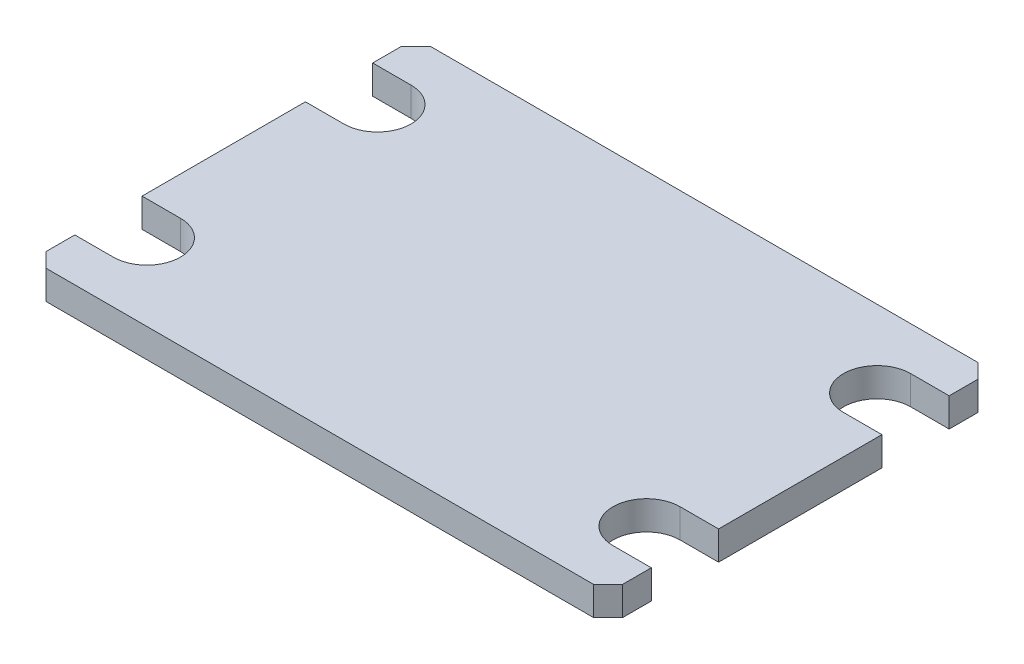
ISO-10303-21;
HEADER;
FILE_DESCRIPTION(('STEP AP214'),'2;1');
FILE_NAME('part.step','',(''),(''),'','','');
FILE_SCHEMA(('AUTOMOTIVE_DESIGN { 1 0 10303 214 1 1 1 1 }'));
ENDSEC;
DATA;
#1=APPLICATION_CONTEXT('core data for automotive mechanical design processes');
#2=APPLICATION_PROTOCOL_DEFINITION('international standard','automotive_design',2000,#1);
#3=PRODUCT_CONTEXT('',#1,'mechanical');
#4=PRODUCT('Part','Part','',(#3));
#5=PRODUCT_RELATED_PRODUCT_CATEGORY('part','',(#4));
#6=PRODUCT_DEFINITION_FORMATION('','',#4);
#7=PRODUCT_DEFINITION_CONTEXT('part definition',#1,'design');
#8=PRODUCT_DEFINITION('design','',#6,#7);
#9=PRODUCT_DEFINITION_SHAPE('','',#8);
#10=(LENGTH_UNIT() NAMED_UNIT(*) SI_UNIT(.MILLI.,.METRE.));
#11=(NAMED_UNIT(*) PLANE_ANGLE_UNIT() SI_UNIT($,.RADIAN.));
#12=(NAMED_UNIT(*) SI_UNIT($,.STERADIAN.) SOLID_ANGLE_UNIT());
#13=UNCERTAINTY_MEASURE_WITH_UNIT(LENGTH_MEASURE(1.E-05),#10,'distance_accuracy_value','');
#14=(GEOMETRIC_REPRESENTATION_CONTEXT(3) GLOBAL_UNCERTAINTY_ASSIGNED_CONTEXT((#13)) GLOBAL_UNIT_ASSIGNED_CONTEXT((#10,
#11,#12)) REPRESENTATION_CONTEXT('',''));
#15=CARTESIAN_POINT('',(0.,0.,0.));
#16=DIRECTION('',(0.,0.,1.));
#17=DIRECTION('',(1.,0.,0.));
#18=AXIS2_PLACEMENT_3D('',#15,#16,#17);
#19=CARTESIAN_POINT('',(190.499999999998,19.0500000000001,-126.999999999999));
#20=DIRECTION('',(1.,0.,0.));
#21=DIRECTION('',(0.,0.,-1.));
#22=AXIS2_PLACEMENT_3D('',#19,#20,#21);
#23=PLANE('',#22);
#24=DIRECTION('',(0.,0.,1.));
#25=VECTOR('',#24,1.);
#26=CARTESIAN_POINT('',(190.499999999998,19.0500000000001,-126.999999999999));
#27=LINE('',#26,#25);
#28=CARTESIAN_POINT('',(190.499999999998,19.0500000000001,98.4250000000009));
#29=VERTEX_POINT('',#28);
#30=CARTESIAN_POINT('',(190.499999999998,19.0500000000001,117.474999999999));
#31=VERTEX_POINT('',#30);
#32=EDGE_CURVE('E354',#29,#31,#27,.T.);
#33=ORIENTED_EDGE('',*,*,#32,.T.);
#34=DIRECTION('',(0.,-1.,0.));
#35=VECTOR('',#34,1.);
#36=CARTESIAN_POINT('',(190.5,0.,117.474999999999));
#37=LINE('',#36,#35);
#38=CARTESIAN_POINT('',(190.5,0.,117.474999999999));
#39=VERTEX_POINT('',#38);
#40=EDGE_CURVE('E359',#31,#39,#37,.T.);
#41=ORIENTED_EDGE('',*,*,#40,.T.);
#42=DIRECTION('',(0.,0.,1.));
#43=VECTOR('',#42,1.);
#44=CARTESIAN_POINT('',(190.5,0.,-126.999999999999));
#45=LINE('',#44,#43);
#46=CARTESIAN_POINT('',(190.5,0.,98.4250000000009));
#47=VERTEX_POINT('',#46);
#48=EDGE_CURVE('E341',#47,#39,#45,.T.);
#49=ORIENTED_EDGE('',*,*,#48,.F.);
#50=DIRECTION('',(0.,-1.,0.));
#51=VECTOR('',#50,1.);
#52=CARTESIAN_POINT('',(190.499999999998,19.0500000000001,98.4250000000009));
#53=LINE('',#52,#51);
#54=EDGE_CURVE('E243',#29,#47,#53,.T.);
#55=ORIENTED_EDGE('',*,*,#54,.F.);
#56=EDGE_LOOP('',(#33,#41,#49,#55));
#57=FACE_BOUND('',#56,.T.);
#58=ADVANCED_FACE('F42',(#57),#23,.T.);
#59=CARTESIAN_POINT('',(-190.5,19.0500000000003,-127.000000000001));
#60=DIRECTION('',(0.,1.,0.));
#61=DIRECTION('',(0.,0.,1.));
#62=AXIS2_PLACEMENT_3D('',#59,#60,#61);
#63=PLANE('',#62);
#64=DIRECTION('',(1.,0.,0.));
#65=VECTOR('',#64,1.);
#66=CARTESIAN_POINT('',(-190.5,19.0500000000003,126.999999999999));
#67=LINE('',#66,#65);
#68=CARTESIAN_POINT('',(-180.975,19.0500000000001,126.999999999999));
#69=VERTEX_POINT('',#68);
#70=CARTESIAN_POINT('',(180.974999999997,19.05,126.999999999999));
#71=VERTEX_POINT('',#70);
#72=EDGE_CURVE('E333',#69,#71,#67,.T.);
#73=ORIENTED_EDGE('',*,*,#72,.T.);
#74=DIRECTION('',(0.707106781186543,0.,-0.707106781186553));
#75=VECTOR('',#74,1.);
#76=CARTESIAN_POINT('',(122.237500000001,19.0499999999999,185.737499999997));
#77=LINE('',#76,#75);
#78=EDGE_CURVE('E380',#71,#31,#77,.T.);
#79=ORIENTED_EDGE('',*,*,#78,.T.);
#80=ORIENTED_EDGE('',*,*,#32,.F.);
#81=DIRECTION('',(-1.,0.,0.));
#82=VECTOR('',#81,1.);
#83=CARTESIAN_POINT('',(190.499999999998,19.0500000000001,98.4250000000009));
#84=LINE('',#83,#82);
#85=CARTESIAN_POINT('',(165.1,19.0500000000004,98.4250000000009));
#86=VERTEX_POINT('',#85);
#87=EDGE_CURVE('E226',#29,#86,#84,.T.);
#88=ORIENTED_EDGE('',*,*,#87,.T.);
#89=CARTESIAN_POINT('',(165.1,19.0500000000004,76.2000000000009));
#90=DIRECTION('',(0.,-1.,0.));
#91=DIRECTION('',(0.,0.,-1.));
#92=AXIS2_PLACEMENT_3D('',#89,#90,#91);
#93=CIRCLE('',#92,22.225);
#94=CARTESIAN_POINT('',(165.1,19.0500000000004,53.975000000001));
#95=VERTEX_POINT('',#94);
#96=EDGE_CURVE('E217',#86,#95,#93,.T.);
#97=ORIENTED_EDGE('',*,*,#96,.T.);
#98=DIRECTION('',(1.,0.,0.));
#99=VECTOR('',#98,1.);
#100=CARTESIAN_POINT('',(165.1,19.0500000000004,53.975000000001));
#101=LINE('',#100,#99);
#102=CARTESIAN_POINT('',(190.499999999998,19.0500000000001,53.975000000001));
#103=VERTEX_POINT('',#102);
#104=EDGE_CURVE('E212',#95,#103,#101,.T.);
#105=ORIENTED_EDGE('',*,*,#104,.T.);
#106=CARTESIAN_POINT('',(190.499999999998,19.0500000000001,-53.974999999999));
#107=VERTEX_POINT('',#106);
#108=EDGE_CURVE('E353',#107,#103,#27,.T.);
#109=ORIENTED_EDGE('',*,*,#108,.F.);
#110=DIRECTION('',(-1.,0.,0.));
#111=VECTOR('',#110,1.);
#112=CARTESIAN_POINT('',(190.499999999998,19.0500000000001,-53.974999999999));
#113=LINE('',#112,#111);
#114=CARTESIAN_POINT('',(165.1,19.0500000000004,-53.974999999999));
#115=VERTEX_POINT('',#114);
#116=EDGE_CURVE('E256',#107,#115,#113,.T.);
#117=ORIENTED_EDGE('',*,*,#116,.T.);
#118=CARTESIAN_POINT('',(165.1,19.0500000000004,-76.1999999999992));
#119=DIRECTION('',(0.,-1.,0.));
#120=DIRECTION('',(0.,0.,-1.));
#121=AXIS2_PLACEMENT_3D('',#118,#119,#120);
#122=CIRCLE('',#121,22.225);
#123=CARTESIAN_POINT('',(165.1,19.0500000000004,-98.4249999999991));
#124=VERTEX_POINT('',#123);
#125=EDGE_CURVE('E260',#115,#124,#122,.T.);
#126=ORIENTED_EDGE('',*,*,#125,.T.);
#127=DIRECTION('',(-1.,0.,0.));
#128=VECTOR('',#127,1.);
#129=CARTESIAN_POINT('',(190.499999999998,19.0500000000001,-98.4249999999991));
#130=LINE('',#129,#128);
#131=CARTESIAN_POINT('',(190.499999999998,19.0500000000001,-98.4249999999991));
#132=VERTEX_POINT('',#131);
#133=EDGE_CURVE('E250',#132,#124,#130,.T.);
#134=ORIENTED_EDGE('',*,*,#133,.F.);
#135=CARTESIAN_POINT('',(190.499999999998,19.0500000000001,-117.474999999999));
#136=VERTEX_POINT('',#135);
#137=EDGE_CURVE('E351',#136,#132,#27,.T.);
#138=ORIENTED_EDGE('',*,*,#137,.F.);
#139=DIRECTION('',(-0.707106781186552,0.,-0.707106781186543));
#140=VECTOR('',#139,1.);
#141=CARTESIAN_POINT('',(-4.76250000000289,19.0499999999996,-312.7375));
#142=LINE('',#141,#140);
#143=CARTESIAN_POINT('',(180.974999999997,19.05,-126.999999999999));
#144=VERTEX_POINT('',#143);
#145=EDGE_CURVE('E376',#136,#144,#142,.T.);
#146=ORIENTED_EDGE('',*,*,#145,.T.);
#147=DIRECTION('',(-1.,0.,0.));
#148=VECTOR('',#147,1.);
#149=CARTESIAN_POINT('',(190.499999999998,19.0500000000001,-126.999999999999));
#150=LINE('',#149,#148);
#151=CARTESIAN_POINT('',(-180.975,19.0500000000001,-126.999999999999));
#152=VERTEX_POINT('',#151);
#153=EDGE_CURVE('E349',#144,#152,#150,.T.);
#154=ORIENTED_EDGE('',*,*,#153,.T.);
#155=DIRECTION('',(-0.707106781186543,0.,0.707106781186553));
#156=VECTOR('',#155,1.);
#157=CARTESIAN_POINT('',(-185.737499999999,19.0500000000004,-122.2375));
#158=LINE('',#157,#156);
#159=CARTESIAN_POINT('',(-190.5,19.0500000000003,-117.474999999999));
#160=VERTEX_POINT('',#159);
#161=EDGE_CURVE('E65',#152,#160,#158,.T.);
#162=ORIENTED_EDGE('',*,*,#161,.T.);
#163=DIRECTION('',(0.,0.,-1.));
#164=VECTOR('',#163,1.);
#165=CARTESIAN_POINT('',(-190.5,19.0500000000003,126.999999999999));
#166=LINE('',#165,#164);
#167=CARTESIAN_POINT('',(-190.5,19.0500000000003,-98.4250000000007));
#168=VERTEX_POINT('',#167);
#169=EDGE_CURVE('E348',#168,#160,#166,.T.);
#170=ORIENTED_EDGE('',*,*,#169,.F.);
#171=DIRECTION('',(1.,0.,0.));
#172=VECTOR('',#171,1.);
#173=CARTESIAN_POINT('',(-190.5,19.0500000000003,-98.4250000000007));
#174=LINE('',#173,#172);
#175=CARTESIAN_POINT('',(-165.099999999997,19.0500000000002,-98.4250000000007));
#176=VERTEX_POINT('',#175);
#177=EDGE_CURVE('E283',#168,#176,#174,.T.);
#178=ORIENTED_EDGE('',*,*,#177,.T.);
#179=CARTESIAN_POINT('',(-165.099999999997,19.0500000000002,-76.2000000000007));
#180=DIRECTION('',(0.,-1.,0.));
#181=DIRECTION('',(0.,0.,-1.));
#182=AXIS2_PLACEMENT_3D('',#179,#180,#181);
#183=CIRCLE('',#182,22.225);
#184=CARTESIAN_POINT('',(-165.099999999997,19.0500000000002,-53.9750000000008));
#185=VERTEX_POINT('',#184);
#186=EDGE_CURVE('E287',#176,#185,#183,.T.);
#187=ORIENTED_EDGE('',*,*,#186,.T.);
#188=DIRECTION('',(1.,0.,0.));
#189=VECTOR('',#188,1.);
#190=CARTESIAN_POINT('',(-190.5,19.0500000000003,-53.9750000000008));
#191=LINE('',#190,#189);
#192=CARTESIAN_POINT('',(-190.5,19.0500000000003,-53.9750000000008));
#193=VERTEX_POINT('',#192);
#194=EDGE_CURVE('E277',#193,#185,#191,.T.);
#195=ORIENTED_EDGE('',*,*,#194,.F.);
#196=CARTESIAN_POINT('',(-190.5,19.0500000000003,53.9749999999992));
#197=VERTEX_POINT('',#196);
#198=EDGE_CURVE('E347',#197,#193,#166,.T.);
#199=ORIENTED_EDGE('',*,*,#198,.F.);
#200=DIRECTION('',(1.,0.,0.));
#201=VECTOR('',#200,1.);
#202=CARTESIAN_POINT('',(-190.5,19.0500000000003,53.9749999999992));
#203=LINE('',#202,#201);
#204=CARTESIAN_POINT('',(-165.099999999997,19.0500000000002,53.9749999999992));
#205=VERTEX_POINT('',#204);
#206=EDGE_CURVE('E310',#197,#205,#203,.T.);
#207=ORIENTED_EDGE('',*,*,#206,.T.);
#208=CARTESIAN_POINT('',(-165.099999999997,19.0500000000002,76.1999999999992));
#209=DIRECTION('',(0.,-1.,0.));
#210=DIRECTION('',(0.,0.,-1.));
#211=AXIS2_PLACEMENT_3D('',#208,#209,#210);
#212=CIRCLE('',#211,22.225);
#213=CARTESIAN_POINT('',(-165.099999999997,19.0500000000002,98.4249999999991));
#214=VERTEX_POINT('',#213);
#215=EDGE_CURVE('E314',#205,#214,#212,.T.);
#216=ORIENTED_EDGE('',*,*,#215,.T.);
#217=DIRECTION('',(1.,0.,0.));
#218=VECTOR('',#217,1.);
#219=CARTESIAN_POINT('',(-190.5,19.0500000000003,98.4249999999991));
#220=LINE('',#219,#218);
#221=CARTESIAN_POINT('',(-190.5,19.0500000000003,98.4249999999991));
#222=VERTEX_POINT('',#221);
#223=EDGE_CURVE('E304',#222,#214,#220,.T.);
#224=ORIENTED_EDGE('',*,*,#223,.F.);
#225=CARTESIAN_POINT('',(-190.5,19.0500000000003,117.474999999999));
#226=VERTEX_POINT('',#225);
#227=EDGE_CURVE('E344',#226,#222,#166,.T.);
#228=ORIENTED_EDGE('',*,*,#227,.F.);
#229=DIRECTION('',(0.707106781186552,0.,0.707106781186543));
#230=VECTOR('',#229,1.);
#231=CARTESIAN_POINT('',(-312.7375,19.0499999999997,-4.76249999999956));
#232=LINE('',#231,#230);
#233=EDGE_CURVE('E378',#226,#69,#232,.T.);
#234=ORIENTED_EDGE('',*,*,#233,.T.);
#235=EDGE_LOOP('',(#73,#79,#80,#88,#97,#105,#109,#117,#126,#134,#138,#146,#154,#162,#170,#178,
#187,#195,#199,#207,#216,#224,#228,#234));
#236=FACE_BOUND('',#235,.T.);
#237=ADVANCED_FACE('F396',(#236),#63,.T.);
#238=CARTESIAN_POINT('',(-190.5,-1.38777878078145E-13,-127.000000000001));
#239=DIRECTION('',(0.,1.,0.));
#240=DIRECTION('',(0.,0.,1.));
#241=AXIS2_PLACEMENT_3D('',#238,#239,#240);
#242=PLANE('',#241);
#243=CARTESIAN_POINT('',(0.,0.,0.));
#244=DIRECTION('',(0.,-1.,0.));
#245=DIRECTION('',(0.,0.,-1.));
#246=AXIS2_PLACEMENT_3D('',#243,#244,#245);
#247=CIRCLE('',#246,122.967221242086);
#248=CARTESIAN_POINT('',(0.,0.,-122.967221242086));
#249=VERTEX_POINT('',#248);
#250=EDGE_CURVE('E327',#249,#249,#247,.T.);
#251=ORIENTED_EDGE('',*,*,#250,.F.);
#252=EDGE_LOOP('',(#251));
#253=FACE_BOUND('',#252,.T.);
#254=ORIENTED_EDGE('',*,*,#48,.T.);
#255=DIRECTION('',(-0.707106781186543,0.,0.707106781186553));
#256=VECTOR('',#255,1.);
#257=CARTESIAN_POINT('',(190.5,0.,117.474999999999));
#258=LINE('',#257,#256);
#259=CARTESIAN_POINT('',(180.975000000001,3.88578058618805E-13,126.999999999999));
#260=VERTEX_POINT('',#259);
#261=EDGE_CURVE('E368',#39,#260,#258,.T.);
#262=ORIENTED_EDGE('',*,*,#261,.T.);
#263=DIRECTION('',(1.,0.,0.));
#264=VECTOR('',#263,1.);
#265=CARTESIAN_POINT('',(-190.5,-1.38777878078145E-13,126.999999999999));
#266=LINE('',#265,#264);
#267=CARTESIAN_POINT('',(-180.975,-3.33066907387547E-13,126.999999999999));
#268=VERTEX_POINT('',#267);
#269=EDGE_CURVE('E330',#268,#260,#266,.T.);
#270=ORIENTED_EDGE('',*,*,#269,.F.);
#271=DIRECTION('',(-0.707106781186552,0.,-0.707106781186543));
#272=VECTOR('',#271,1.);
#273=CARTESIAN_POINT('',(-180.975,-3.33066907387547E-13,126.999999999999));
#274=LINE('',#273,#272);
#275=CARTESIAN_POINT('',(-190.5,-1.38777878078145E-13,117.474999999999));
#276=VERTEX_POINT('',#275);
#277=EDGE_CURVE('E366',#268,#276,#274,.T.);
#278=ORIENTED_EDGE('',*,*,#277,.T.);
#279=DIRECTION('',(0.,0.,-1.));
#280=VECTOR('',#279,1.);
#281=CARTESIAN_POINT('',(-190.5,-1.38777878078145E-13,126.999999999999));
#282=LINE('',#281,#280);
#283=CARTESIAN_POINT('',(-190.5,-1.38777878078145E-13,98.4249999999991));
#284=VERTEX_POINT('',#283);
#285=EDGE_CURVE('E331',#276,#284,#282,.T.);
#286=ORIENTED_EDGE('',*,*,#285,.T.);
#287=DIRECTION('',(1.,0.,0.));
#288=VECTOR('',#287,1.);
#289=CARTESIAN_POINT('',(-190.5,-1.38777878078145E-13,98.4249999999991));
#290=LINE('',#289,#288);
#291=CARTESIAN_POINT('',(-165.1,4.16333634234434E-13,98.4249999999991));
#292=VERTEX_POINT('',#291);
#293=EDGE_CURVE('E300',#284,#292,#290,.T.);
#294=ORIENTED_EDGE('',*,*,#293,.T.);
#295=CARTESIAN_POINT('',(-165.1,4.16333634234434E-13,76.1999999999992));
#296=DIRECTION('',(0.,-1.,0.));
#297=DIRECTION('',(0.,0.,-1.));
#298=AXIS2_PLACEMENT_3D('',#295,#296,#297);
#299=CIRCLE('',#298,22.225);
#300=CARTESIAN_POINT('',(-165.1,4.16333634234434E-13,53.9749999999992));
#301=VERTEX_POINT('',#300);
#302=EDGE_CURVE('E305',#301,#292,#299,.T.);
#303=ORIENTED_EDGE('',*,*,#302,.F.);
#304=DIRECTION('',(1.,0.,0.));
#305=VECTOR('',#304,1.);
#306=CARTESIAN_POINT('',(-190.5,-1.38777878078145E-13,53.9749999999992));
#307=LINE('',#306,#305);
#308=CARTESIAN_POINT('',(-190.5,-1.38777878078145E-13,53.9749999999992));
#309=VERTEX_POINT('',#308);
#310=EDGE_CURVE('E301',#309,#301,#307,.T.);
#311=ORIENTED_EDGE('',*,*,#310,.F.);
#312=CARTESIAN_POINT('',(-190.5,-1.38777878078145E-13,-53.9750000000008));
#313=VERTEX_POINT('',#312);
#314=EDGE_CURVE('E334',#309,#313,#282,.T.);
#315=ORIENTED_EDGE('',*,*,#314,.T.);
#316=DIRECTION('',(1.,0.,0.));
#317=VECTOR('',#316,1.);
#318=CARTESIAN_POINT('',(-190.5,-1.38777878078145E-13,-53.9750000000008));
#319=LINE('',#318,#317);
#320=CARTESIAN_POINT('',(-165.1,4.16333634234434E-13,-53.9750000000008));
#321=VERTEX_POINT('',#320);
#322=EDGE_CURVE('E273',#313,#321,#319,.T.);
#323=ORIENTED_EDGE('',*,*,#322,.T.);
#324=CARTESIAN_POINT('',(-165.1,4.16333634234434E-13,-76.2000000000007));
#325=DIRECTION('',(0.,-1.,0.));
#326=DIRECTION('',(0.,0.,-1.));
#327=AXIS2_PLACEMENT_3D('',#324,#325,#326);
#328=CIRCLE('',#327,22.225);
#329=CARTESIAN_POINT('',(-165.100000000001,4.16333634234434E-13,-98.4250000000007));
#330=VERTEX_POINT('',#329);
#331=EDGE_CURVE('E278',#330,#321,#328,.T.);
#332=ORIENTED_EDGE('',*,*,#331,.F.);
#333=DIRECTION('',(1.,0.,0.));
#334=VECTOR('',#333,1.);
#335=CARTESIAN_POINT('',(-190.5,-1.38777878078145E-13,-98.4250000000007));
#336=LINE('',#335,#334);
#337=CARTESIAN_POINT('',(-190.5,-1.38777878078145E-13,-98.4250000000007));
#338=VERTEX_POINT('',#337);
#339=EDGE_CURVE('E274',#338,#330,#336,.T.);
#340=ORIENTED_EDGE('',*,*,#339,.F.);
#341=CARTESIAN_POINT('',(-190.5,-1.38777878078145E-13,-117.474999999999));
#342=VERTEX_POINT('',#341);
#343=EDGE_CURVE('E335',#338,#342,#282,.T.);
#344=ORIENTED_EDGE('',*,*,#343,.T.);
#345=DIRECTION('',(0.707106781186543,0.,-0.707106781186553));
#346=VECTOR('',#345,1.);
#347=CARTESIAN_POINT('',(-190.5,-1.38777878078145E-13,-117.474999999999));
#348=LINE('',#347,#346);
#349=CARTESIAN_POINT('',(-180.975,-3.33066907387547E-13,-126.999999999999));
#350=VERTEX_POINT('',#349);
#351=EDGE_CURVE('E362',#342,#350,#348,.T.);
#352=ORIENTED_EDGE('',*,*,#351,.T.);
#353=DIRECTION('',(-1.,0.,0.));
#354=VECTOR('',#353,1.);
#355=CARTESIAN_POINT('',(190.5,0.,-126.999999999999));
#356=LINE('',#355,#354);
#357=CARTESIAN_POINT('',(180.975000000001,3.88578058618805E-13,-126.999999999999));
#358=VERTEX_POINT('',#357);
#359=EDGE_CURVE('E336',#358,#350,#356,.T.);
#360=ORIENTED_EDGE('',*,*,#359,.F.);
#361=DIRECTION('',(0.707106781186552,0.,0.707106781186543));
#362=VECTOR('',#361,1.);
#363=CARTESIAN_POINT('',(180.975000000001,3.88578058618805E-13,-126.999999999999));
#364=LINE('',#363,#362);
#365=CARTESIAN_POINT('',(190.5,0.,-117.474999999999));
#366=VERTEX_POINT('',#365);
#367=EDGE_CURVE('E364',#358,#366,#364,.T.);
#368=ORIENTED_EDGE('',*,*,#367,.T.);
#369=CARTESIAN_POINT('',(190.5,0.,-98.4249999999991));
#370=VERTEX_POINT('',#369);
#371=EDGE_CURVE('E339',#366,#370,#45,.T.);
#372=ORIENTED_EDGE('',*,*,#371,.T.);
#373=DIRECTION('',(-1.,0.,0.));
#374=VECTOR('',#373,1.);
#375=CARTESIAN_POINT('',(190.5,0.,-98.4249999999991));
#376=LINE('',#375,#374);
#377=CARTESIAN_POINT('',(165.1,-3.33066907387547E-13,-98.4249999999991));
#378=VERTEX_POINT('',#377);
#379=EDGE_CURVE('E246',#370,#378,#376,.T.);
#380=ORIENTED_EDGE('',*,*,#379,.T.);
#381=CARTESIAN_POINT('',(165.1,-3.33066907387547E-13,-76.1999999999992));
#382=DIRECTION('',(0.,-1.,0.));
#383=DIRECTION('',(0.,0.,-1.));
#384=AXIS2_PLACEMENT_3D('',#381,#382,#383);
#385=CIRCLE('',#384,22.225);
#386=CARTESIAN_POINT('',(165.1,-3.33066907387547E-13,-53.974999999999));
#387=VERTEX_POINT('',#386);
#388=EDGE_CURVE('E251',#387,#378,#385,.T.);
#389=ORIENTED_EDGE('',*,*,#388,.F.);
#390=DIRECTION('',(-1.,0.,0.));
#391=VECTOR('',#390,1.);
#392=CARTESIAN_POINT('',(190.5,0.,-53.974999999999));
#393=LINE('',#392,#391);
#394=CARTESIAN_POINT('',(190.5,0.,-53.974999999999));
#395=VERTEX_POINT('',#394);
#396=EDGE_CURVE('E247',#395,#387,#393,.T.);
#397=ORIENTED_EDGE('',*,*,#396,.F.);
#398=CARTESIAN_POINT('',(190.5,0.,53.975000000001));
#399=VERTEX_POINT('',#398);
#400=EDGE_CURVE('E233',#395,#399,#45,.T.);
#401=ORIENTED_EDGE('',*,*,#400,.T.);
#402=DIRECTION('',(1.,0.,0.));
#403=VECTOR('',#402,1.);
#404=CARTESIAN_POINT('',(165.1,-3.33066907387547E-13,53.975000000001));
#405=LINE('',#404,#403);
#406=CARTESIAN_POINT('',(165.1,-3.33066907387547E-13,53.975000000001));
#407=VERTEX_POINT('',#406);
#408=EDGE_CURVE('E209',#407,#399,#405,.T.);
#409=ORIENTED_EDGE('',*,*,#408,.F.);
#410=CARTESIAN_POINT('',(165.1,-3.33066907387547E-13,76.2000000000009));
#411=DIRECTION('',(0.,-1.,0.));
#412=DIRECTION('',(0.,0.,-1.));
#413=AXIS2_PLACEMENT_3D('',#410,#411,#412);
#414=CIRCLE('',#413,22.225);
#415=CARTESIAN_POINT('',(165.1,-3.33066907387547E-13,98.4250000000009));
#416=VERTEX_POINT('',#415);
#417=EDGE_CURVE('E220',#416,#407,#414,.T.);
#418=ORIENTED_EDGE('',*,*,#417,.F.);
#419=DIRECTION('',(-1.,0.,0.));
#420=VECTOR('',#419,1.);
#421=CARTESIAN_POINT('',(190.5,0.,98.4250000000009));
#422=LINE('',#421,#420);
#423=EDGE_CURVE('E234',#47,#416,#422,.T.);
#424=ORIENTED_EDGE('',*,*,#423,.F.);
#425=EDGE_LOOP('',(#254,#262,#270,#278,#286,#294,#303,#311,#315,#323,#332,#340,#344,#352,#360,
#368,#372,#380,#389,#397,#401,#409,#418,#424));
#426=FACE_BOUND('',#425,.T.);
#427=ADVANCED_FACE('F230',(#253,#426),#242,.F.);
#428=ORIENTED_EDGE('',*,*,#371,.F.);
#429=DIRECTION('',(0.,1.,0.));
#430=VECTOR('',#429,1.);
#431=CARTESIAN_POINT('',(190.499999999998,19.0500000000001,-117.474999999999));
#432=LINE('',#431,#430);
#433=EDGE_CURVE('E50',#366,#136,#432,.T.);
#434=ORIENTED_EDGE('',*,*,#433,.T.);
#435=ORIENTED_EDGE('',*,*,#137,.T.);
#436=DIRECTION('',(0.,-1.,0.));
#437=VECTOR('',#436,1.);
#438=CARTESIAN_POINT('',(190.499999999998,19.0500000000001,-98.4249999999991));
#439=LINE('',#438,#437);
#440=EDGE_CURVE('E270',#132,#370,#439,.T.);
#441=ORIENTED_EDGE('',*,*,#440,.T.);
#442=EDGE_LOOP('',(#428,#434,#435,#441));
#443=FACE_BOUND('',#442,.T.);
#444=ADVANCED_FACE('F391',(#443),#23,.T.);
#445=CARTESIAN_POINT('',(-190.5,19.0500000000003,126.999999999999));
#446=DIRECTION('',(-1.,0.,0.));
#447=DIRECTION('',(0.,0.,1.));
#448=AXIS2_PLACEMENT_3D('',#445,#446,#447);
#449=PLANE('',#448);
#450=ORIENTED_EDGE('',*,*,#198,.T.);
#451=DIRECTION('',(0.,-1.,0.));
#452=VECTOR('',#451,1.);
#453=CARTESIAN_POINT('',(-190.5,19.0500000000003,-53.9750000000008));
#454=LINE('',#453,#452);
#455=EDGE_CURVE('E297',#193,#313,#454,.T.);
#456=ORIENTED_EDGE('',*,*,#455,.T.);
#457=ORIENTED_EDGE('',*,*,#314,.F.);
#458=DIRECTION('',(0.,-1.,0.));
#459=VECTOR('',#458,1.);
#460=CARTESIAN_POINT('',(-190.5,19.0500000000003,53.9749999999992));
#461=LINE('',#460,#459);
#462=EDGE_CURVE('E313',#197,#309,#461,.T.);
#463=ORIENTED_EDGE('',*,*,#462,.F.);
#464=EDGE_LOOP('',(#450,#456,#457,#463));
#465=FACE_BOUND('',#464,.T.);
#466=ADVANCED_FACE('F417',(#465),#449,.T.);
#467=ORIENTED_EDGE('',*,*,#285,.F.);
#468=DIRECTION('',(0.,1.,0.));
#469=VECTOR('',#468,1.);
#470=CARTESIAN_POINT('',(-190.5,19.0500000000003,117.474999999999));
#471=LINE('',#470,#469);
#472=EDGE_CURVE('E57',#276,#226,#471,.T.);
#473=ORIENTED_EDGE('',*,*,#472,.T.);
#474=ORIENTED_EDGE('',*,*,#227,.T.);
#475=DIRECTION('',(0.,-1.,0.));
#476=VECTOR('',#475,1.);
#477=CARTESIAN_POINT('',(-190.5,19.0500000000003,98.4249999999991));
#478=LINE('',#477,#476);
#479=EDGE_CURVE('E324',#222,#284,#478,.T.);
#480=ORIENTED_EDGE('',*,*,#479,.T.);
#481=EDGE_LOOP('',(#467,#473,#474,#480));
#482=FACE_BOUND('',#481,.T.);
#483=ADVANCED_FACE('F438',(#482),#449,.T.);
#484=ORIENTED_EDGE('',*,*,#169,.T.);
#485=DIRECTION('',(0.,-1.,0.));
#486=VECTOR('',#485,1.);
#487=CARTESIAN_POINT('',(-190.5,-1.38777878078145E-13,-117.474999999999));
#488=LINE('',#487,#486);
#489=EDGE_CURVE('E13',#160,#342,#488,.T.);
#490=ORIENTED_EDGE('',*,*,#489,.T.);
#491=ORIENTED_EDGE('',*,*,#343,.F.);
#492=DIRECTION('',(0.,-1.,0.));
#493=VECTOR('',#492,1.);
#494=CARTESIAN_POINT('',(-190.5,19.0500000000003,-98.4250000000007));
#495=LINE('',#494,#493);
#496=EDGE_CURVE('E286',#168,#338,#495,.T.);
#497=ORIENTED_EDGE('',*,*,#496,.F.);
#498=EDGE_LOOP('',(#484,#490,#491,#497));
#499=FACE_BOUND('',#498,.T.);
#500=ADVANCED_FACE('F411',(#499),#449,.T.);
#501=CARTESIAN_POINT('',(-190.5,19.0500000000003,126.999999999999));
#502=DIRECTION('',(0.,0.,-1.));
#503=DIRECTION('',(-1.,0.,0.));
#504=AXIS2_PLACEMENT_3D('',#501,#502,#503);
#505=PLANE('',#504);
#506=ORIENTED_EDGE('',*,*,#269,.T.);
#507=DIRECTION('',(0.,1.,0.));
#508=VECTOR('',#507,1.);
#509=CARTESIAN_POINT('',(180.974999999997,19.05,126.999999999999));
#510=LINE('',#509,#508);
#511=EDGE_CURVE('E373',#260,#71,#510,.T.);
#512=ORIENTED_EDGE('',*,*,#511,.T.);
#513=ORIENTED_EDGE('',*,*,#72,.F.);
#514=DIRECTION('',(0.,-1.,0.));
#515=VECTOR('',#514,1.);
#516=CARTESIAN_POINT('',(-180.975,-3.33066907387547E-13,126.999999999999));
#517=LINE('',#516,#515);
#518=EDGE_CURVE('E370',#69,#268,#517,.T.);
#519=ORIENTED_EDGE('',*,*,#518,.T.);
#520=EDGE_LOOP('',(#506,#512,#513,#519));
#521=FACE_BOUND('',#520,.T.);
#522=ADVANCED_FACE('F44',(#521),#505,.F.);
#523=DIRECTION('',(0.,-1.,0.));
#524=VECTOR('',#523,1.);
#525=CARTESIAN_POINT('',(190.499999999998,19.0500000000001,53.975000000001));
#526=LINE('',#525,#524);
#527=EDGE_CURVE('E216',#103,#399,#526,.T.);
#528=ORIENTED_EDGE('',*,*,#527,.T.);
#529=ORIENTED_EDGE('',*,*,#400,.F.);
#530=DIRECTION('',(0.,-1.,0.));
#531=VECTOR('',#530,1.);
#532=CARTESIAN_POINT('',(190.499999999998,19.0500000000001,-53.974999999999));
#533=LINE('',#532,#531);
#534=EDGE_CURVE('E259',#107,#395,#533,.T.);
#535=ORIENTED_EDGE('',*,*,#534,.F.);
#536=ORIENTED_EDGE('',*,*,#108,.T.);
#537=EDGE_LOOP('',(#528,#529,#535,#536));
#538=FACE_BOUND('',#537,.T.);
#539=ADVANCED_FACE('F459',(#538),#23,.T.);
#540=CARTESIAN_POINT('',(190.499999999998,19.0500000000001,-126.999999999999));
#541=DIRECTION('',(0.,0.,1.));
#542=DIRECTION('',(1.,0.,0.));
#543=AXIS2_PLACEMENT_3D('',#540,#541,#542);
#544=PLANE('',#543);
#545=ORIENTED_EDGE('',*,*,#153,.F.);
#546=DIRECTION('',(0.,-1.,0.));
#547=VECTOR('',#546,1.);
#548=CARTESIAN_POINT('',(180.975000000001,3.88578058618805E-13,-126.999999999999));
#549=LINE('',#548,#547);
#550=EDGE_CURVE('E385',#144,#358,#549,.T.);
#551=ORIENTED_EDGE('',*,*,#550,.T.);
#552=ORIENTED_EDGE('',*,*,#359,.T.);
#553=DIRECTION('',(0.,1.,0.));
#554=VECTOR('',#553,1.);
#555=CARTESIAN_POINT('',(-180.975,19.0500000000001,-126.999999999999));
#556=LINE('',#555,#554);
#557=EDGE_CURVE('E383',#350,#152,#556,.T.);
#558=ORIENTED_EDGE('',*,*,#557,.T.);
#559=EDGE_LOOP('',(#545,#551,#552,#558));
#560=FACE_BOUND('',#559,.T.);
#561=ADVANCED_FACE('F402',(#560),#544,.F.);
#562=CARTESIAN_POINT('',(0.,222.25,0.));
#563=DIRECTION('',(0.,0.,1.));
#564=DIRECTION('',(1.,0.,0.));
#565=AXIS2_PLACEMENT_3D('',#562,#563,#564);
#566=SPHERICAL_SURFACE('',#565,254.);
#567=CARTESIAN_POINT('',(0.,222.25,0.));
#568=DIRECTION('',(0.,1.,0.));
#569=DIRECTION('',(0.,0.,1.));
#570=AXIS2_PLACEMENT_3D('',#567,#568,#569);
#571=SPHERICAL_SURFACE('',#570,254.);
#572=CARTESIAN_POINT('',(-1.66533453693773E-12,-25.4,0.));
#573=DIRECTION('',(0.,1.,0.));
#574=DIRECTION('',(0.,0.,1.));
#575=AXIS2_PLACEMENT_3D('',#572,#573,#574);
#576=CIRCLE('',#575,56.4400345499548);
#577=CARTESIAN_POINT('',(-1.66533453693773E-12,-25.4,56.4400345499548));
#578=VERTEX_POINT('',#577);
#579=EDGE_CURVE('E346',#578,#578,#576,.F.);
#580=ORIENTED_EDGE('',*,*,#579,.F.);
#581=EDGE_LOOP('',(#580));
#582=FACE_BOUND('',#581,.T.);
#583=ORIENTED_EDGE('',*,*,#250,.T.);
#584=EDGE_LOOP('',(#583));
#585=FACE_BOUND('',#584,.T.);
#586=ADVANCED_FACE('F485',(#582,#585),#571,.T.);
#587=CARTESIAN_POINT('',(-190.5,19.0500000000003,98.4249999999991));
#588=DIRECTION('',(0.,0.,-1.));
#589=DIRECTION('',(-1.,0.,0.));
#590=AXIS2_PLACEMENT_3D('',#587,#588,#589);
#591=PLANE('',#590);
#592=DIRECTION('',(0.,-1.,0.));
#593=VECTOR('',#592,1.);
#594=CARTESIAN_POINT('',(-165.099999999997,19.0500000000002,98.4249999999991));
#595=LINE('',#594,#593);
#596=EDGE_CURVE('E322',#214,#292,#595,.T.);
#597=ORIENTED_EDGE('',*,*,#596,.T.);
#598=ORIENTED_EDGE('',*,*,#293,.F.);
#599=ORIENTED_EDGE('',*,*,#479,.F.);
#600=ORIENTED_EDGE('',*,*,#223,.T.);
#601=EDGE_LOOP('',(#597,#598,#599,#600));
#602=FACE_BOUND('',#601,.T.);
#603=ADVANCED_FACE('F436',(#602),#591,.T.);
#604=CARTESIAN_POINT('',(-165.099999999997,19.0500000000002,76.1999999999992));
#605=DIRECTION('',(0.,-1.,0.));
#606=DIRECTION('',(0.,0.,-1.));
#607=AXIS2_PLACEMENT_3D('',#604,#605,#606);
#608=CYLINDRICAL_SURFACE('',#607,22.225);
#609=DIRECTION('',(0.,-1.,0.));
#610=VECTOR('',#609,1.);
#611=CARTESIAN_POINT('',(-165.099999999997,19.0500000000002,53.9749999999992));
#612=LINE('',#611,#610);
#613=EDGE_CURVE('E320',#205,#301,#612,.T.);
#614=ORIENTED_EDGE('',*,*,#613,.T.);
#615=ORIENTED_EDGE('',*,*,#302,.T.);
#616=ORIENTED_EDGE('',*,*,#596,.F.);
#617=ORIENTED_EDGE('',*,*,#215,.F.);
#618=EDGE_LOOP('',(#614,#615,#616,#617));
#619=FACE_BOUND('',#618,.T.);
#620=ADVANCED_FACE('F431',(#619),#608,.F.);
#621=CARTESIAN_POINT('',(-190.5,19.0500000000003,53.9749999999992));
#622=DIRECTION('',(0.,0.,-1.));
#623=DIRECTION('',(-1.,0.,0.));
#624=AXIS2_PLACEMENT_3D('',#621,#622,#623);
#625=PLANE('',#624);
#626=ORIENTED_EDGE('',*,*,#206,.F.);
#627=ORIENTED_EDGE('',*,*,#462,.T.);
#628=ORIENTED_EDGE('',*,*,#310,.T.);
#629=ORIENTED_EDGE('',*,*,#613,.F.);
#630=EDGE_LOOP('',(#626,#627,#628,#629));
#631=FACE_BOUND('',#630,.T.);
#632=ADVANCED_FACE('F428',(#631),#625,.F.);
#633=CARTESIAN_POINT('',(-190.5,19.0500000000003,-53.9750000000008));
#634=DIRECTION('',(0.,0.,-1.));
#635=DIRECTION('',(-1.,0.,0.));
#636=AXIS2_PLACEMENT_3D('',#633,#634,#635);
#637=PLANE('',#636);
#638=DIRECTION('',(0.,-1.,0.));
#639=VECTOR('',#638,1.);
#640=CARTESIAN_POINT('',(-165.099999999997,19.0500000000002,-53.9750000000008));
#641=LINE('',#640,#639);
#642=EDGE_CURVE('E295',#185,#321,#641,.T.);
#643=ORIENTED_EDGE('',*,*,#642,.T.);
#644=ORIENTED_EDGE('',*,*,#322,.F.);
#645=ORIENTED_EDGE('',*,*,#455,.F.);
#646=ORIENTED_EDGE('',*,*,#194,.T.);
#647=EDGE_LOOP('',(#643,#644,#645,#646));
#648=FACE_BOUND('',#647,.T.);
#649=ADVANCED_FACE('F423',(#648),#637,.T.);
#650=CARTESIAN_POINT('',(-165.099999999997,19.0500000000002,-76.2000000000007));
#651=DIRECTION('',(0.,-1.,0.));
#652=DIRECTION('',(0.,0.,-1.));
#653=AXIS2_PLACEMENT_3D('',#650,#651,#652);
#654=CYLINDRICAL_SURFACE('',#653,22.225);
#655=DIRECTION('',(0.,-1.,0.));
#656=VECTOR('',#655,1.);
#657=CARTESIAN_POINT('',(-165.099999999997,19.0500000000002,-98.4250000000007));
#658=LINE('',#657,#656);
#659=EDGE_CURVE('E293',#176,#330,#658,.T.);
#660=ORIENTED_EDGE('',*,*,#659,.T.);
#661=ORIENTED_EDGE('',*,*,#331,.T.);
#662=ORIENTED_EDGE('',*,*,#642,.F.);
#663=ORIENTED_EDGE('',*,*,#186,.F.);
#664=EDGE_LOOP('',(#660,#661,#662,#663));
#665=FACE_BOUND('',#664,.T.);
#666=ADVANCED_FACE('F564',(#665),#654,.F.);
#667=CARTESIAN_POINT('',(-190.5,19.0500000000003,-98.4250000000007));
#668=DIRECTION('',(0.,0.,-1.));
#669=DIRECTION('',(-1.,0.,0.));
#670=AXIS2_PLACEMENT_3D('',#667,#668,#669);
#671=PLANE('',#670);
#672=ORIENTED_EDGE('',*,*,#177,.F.);
#673=ORIENTED_EDGE('',*,*,#496,.T.);
#674=ORIENTED_EDGE('',*,*,#339,.T.);
#675=ORIENTED_EDGE('',*,*,#659,.F.);
#676=EDGE_LOOP('',(#672,#673,#674,#675));
#677=FACE_BOUND('',#676,.T.);
#678=ADVANCED_FACE('F573',(#677),#671,.F.);
#679=CARTESIAN_POINT('',(190.499999999998,19.0500000000001,-98.4249999999991));
#680=DIRECTION('',(0.,0.,1.));
#681=DIRECTION('',(1.,0.,0.));
#682=AXIS2_PLACEMENT_3D('',#679,#680,#681);
#683=PLANE('',#682);
#684=DIRECTION('',(0.,-1.,0.));
#685=VECTOR('',#684,1.);
#686=CARTESIAN_POINT('',(165.1,19.0500000000004,-98.4249999999991));
#687=LINE('',#686,#685);
#688=EDGE_CURVE('E268',#124,#378,#687,.T.);
#689=ORIENTED_EDGE('',*,*,#688,.T.);
#690=ORIENTED_EDGE('',*,*,#379,.F.);
#691=ORIENTED_EDGE('',*,*,#440,.F.);
#692=ORIENTED_EDGE('',*,*,#133,.T.);
#693=EDGE_LOOP('',(#689,#690,#691,#692));
#694=FACE_BOUND('',#693,.T.);
#695=ADVANCED_FACE('F583',(#694),#683,.T.);
#696=CARTESIAN_POINT('',(165.1,19.0500000000004,-76.1999999999992));
#697=DIRECTION('',(0.,-1.,0.));
#698=DIRECTION('',(0.,0.,-1.));
#699=AXIS2_PLACEMENT_3D('',#696,#697,#698);
#700=CYLINDRICAL_SURFACE('',#699,22.225);
#701=DIRECTION('',(0.,-1.,0.));
#702=VECTOR('',#701,1.);
#703=CARTESIAN_POINT('',(165.1,19.0500000000004,-53.974999999999));
#704=LINE('',#703,#702);
#705=EDGE_CURVE('E266',#115,#387,#704,.T.);
#706=ORIENTED_EDGE('',*,*,#705,.T.);
#707=ORIENTED_EDGE('',*,*,#388,.T.);
#708=ORIENTED_EDGE('',*,*,#688,.F.);
#709=ORIENTED_EDGE('',*,*,#125,.F.);
#710=EDGE_LOOP('',(#706,#707,#708,#709));
#711=FACE_BOUND('',#710,.T.);
#712=ADVANCED_FACE('F593',(#711),#700,.F.);
#713=CARTESIAN_POINT('',(190.499999999998,19.0500000000001,-53.974999999999));
#714=DIRECTION('',(0.,0.,1.));
#715=DIRECTION('',(1.,0.,0.));
#716=AXIS2_PLACEMENT_3D('',#713,#714,#715);
#717=PLANE('',#716);
#718=ORIENTED_EDGE('',*,*,#116,.F.);
#719=ORIENTED_EDGE('',*,*,#534,.T.);
#720=ORIENTED_EDGE('',*,*,#396,.T.);
#721=ORIENTED_EDGE('',*,*,#705,.F.);
#722=EDGE_LOOP('',(#718,#719,#720,#721));
#723=FACE_BOUND('',#722,.T.);
#724=ADVANCED_FACE('F470',(#723),#717,.F.);
#725=CARTESIAN_POINT('',(165.1,19.0500000000004,76.2000000000009));
#726=DIRECTION('',(0.,-1.,0.));
#727=DIRECTION('',(0.,0.,-1.));
#728=AXIS2_PLACEMENT_3D('',#725,#726,#727);
#729=CYLINDRICAL_SURFACE('',#728,22.225);
#730=DIRECTION('',(0.,-1.,0.));
#731=VECTOR('',#730,1.);
#732=CARTESIAN_POINT('',(165.1,19.0500000000004,98.4250000000009));
#733=LINE('',#732,#731);
#734=EDGE_CURVE('E222',#86,#416,#733,.T.);
#735=ORIENTED_EDGE('',*,*,#734,.T.);
#736=ORIENTED_EDGE('',*,*,#417,.T.);
#737=DIRECTION('',(0.,-1.,0.));
#738=VECTOR('',#737,1.);
#739=CARTESIAN_POINT('',(165.1,19.0500000000004,53.975000000001));
#740=LINE('',#739,#738);
#741=EDGE_CURVE('E205',#95,#407,#740,.T.);
#742=ORIENTED_EDGE('',*,*,#741,.F.);
#743=ORIENTED_EDGE('',*,*,#96,.F.);
#744=EDGE_LOOP('',(#735,#736,#742,#743));
#745=FACE_BOUND('',#744,.T.);
#746=ADVANCED_FACE('F221',(#745),#729,.F.);
#747=CARTESIAN_POINT('',(190.499999999998,19.0500000000001,98.4250000000009));
#748=DIRECTION('',(0.,0.,1.));
#749=DIRECTION('',(1.,0.,0.));
#750=AXIS2_PLACEMENT_3D('',#747,#748,#749);
#751=PLANE('',#750);
#752=ORIENTED_EDGE('',*,*,#54,.T.);
#753=ORIENTED_EDGE('',*,*,#423,.T.);
#754=ORIENTED_EDGE('',*,*,#734,.F.);
#755=ORIENTED_EDGE('',*,*,#87,.F.);
#756=EDGE_LOOP('',(#752,#753,#754,#755));
#757=FACE_BOUND('',#756,.T.);
#758=ADVANCED_FACE('F461',(#757),#751,.F.);
#759=CARTESIAN_POINT('',(165.1,19.0500000000004,53.975000000001));
#760=DIRECTION('',(0.,0.,-1.));
#761=DIRECTION('',(-1.,0.,0.));
#762=AXIS2_PLACEMENT_3D('',#759,#760,#761);
#763=PLANE('',#762);
#764=ORIENTED_EDGE('',*,*,#104,.F.);
#765=ORIENTED_EDGE('',*,*,#741,.T.);
#766=ORIENTED_EDGE('',*,*,#408,.T.);
#767=ORIENTED_EDGE('',*,*,#527,.F.);
#768=EDGE_LOOP('',(#764,#765,#766,#767));
#769=FACE_BOUND('',#768,.T.);
#770=ADVANCED_FACE('F207',(#769),#763,.F.);
#771=CARTESIAN_POINT('',(56.4400345499544,-25.3999999999996,-127.000000000001));
#772=DIRECTION('',(0.,1.,0.));
#773=DIRECTION('',(0.,0.,1.));
#774=AXIS2_PLACEMENT_3D('',#771,#772,#773);
#775=PLANE('',#774);
#776=ORIENTED_EDGE('',*,*,#579,.T.);
#777=EDGE_LOOP('',(#776));
#778=FACE_BOUND('',#777,.T.);
#779=ADVANCED_FACE('F468',(#778),#775,.F.);
#780=CARTESIAN_POINT('',(190.499999999998,19.0500000000001,117.474999999999));
#781=DIRECTION('',(0.707106781186553,0.,0.707106781186542));
#782=DIRECTION('',(0.707106781186543,0.,-0.707106781186553));
#783=AXIS2_PLACEMENT_3D('',#780,#781,#782);
#784=PLANE('',#783);
#785=ORIENTED_EDGE('',*,*,#78,.F.);
#786=ORIENTED_EDGE('',*,*,#511,.F.);
#787=ORIENTED_EDGE('',*,*,#261,.F.);
#788=ORIENTED_EDGE('',*,*,#40,.F.);
#789=EDGE_LOOP('',(#785,#786,#787,#788));
#790=FACE_BOUND('',#789,.T.);
#791=ADVANCED_FACE('F448',(#790),#784,.T.);
#792=CARTESIAN_POINT('',(-180.975,19.0500000000001,126.999999999999));
#793=DIRECTION('',(-0.707106781186544,0.,0.707106781186552));
#794=DIRECTION('',(0.707106781186552,0.,0.707106781186543));
#795=AXIS2_PLACEMENT_3D('',#792,#793,#794);
#796=PLANE('',#795);
#797=ORIENTED_EDGE('',*,*,#233,.F.);
#798=ORIENTED_EDGE('',*,*,#472,.F.);
#799=ORIENTED_EDGE('',*,*,#277,.F.);
#800=ORIENTED_EDGE('',*,*,#518,.F.);
#801=EDGE_LOOP('',(#797,#798,#799,#800));
#802=FACE_BOUND('',#801,.T.);
#803=ADVANCED_FACE('F440',(#802),#796,.T.);
#804=CARTESIAN_POINT('',(180.974999999997,19.05,-126.999999999999));
#805=DIRECTION('',(0.707106781186544,0.,-0.707106781186552));
#806=DIRECTION('',(-0.707106781186552,0.,-0.707106781186543));
#807=AXIS2_PLACEMENT_3D('',#804,#805,#806);
#808=PLANE('',#807);
#809=ORIENTED_EDGE('',*,*,#145,.F.);
#810=ORIENTED_EDGE('',*,*,#433,.F.);
#811=ORIENTED_EDGE('',*,*,#367,.F.);
#812=ORIENTED_EDGE('',*,*,#550,.F.);
#813=EDGE_LOOP('',(#809,#810,#811,#812));
#814=FACE_BOUND('',#813,.T.);
#815=ADVANCED_FACE('F399',(#814),#808,.T.);
#816=CARTESIAN_POINT('',(-190.5,19.0500000000003,-117.474999999999));
#817=DIRECTION('',(-0.707106781186553,0.,-0.707106781186542));
#818=DIRECTION('',(-0.707106781186543,0.,0.707106781186553));
#819=AXIS2_PLACEMENT_3D('',#816,#817,#818);
#820=PLANE('',#819);
#821=ORIENTED_EDGE('',*,*,#161,.F.);
#822=ORIENTED_EDGE('',*,*,#557,.F.);
#823=ORIENTED_EDGE('',*,*,#351,.F.);
#824=ORIENTED_EDGE('',*,*,#489,.F.);
#825=EDGE_LOOP('',(#821,#822,#823,#824));
#826=FACE_BOUND('',#825,.T.);
#827=ADVANCED_FACE('F409',(#826),#820,.T.);
#828=CLOSED_SHELL('',(#58,#237,#427,#444,#466,#483,#500,#522,#539,#561,#586,#603,#620,#632,#649,
#666,#678,#695,#712,#724,#746,#758,#770,#779,#791,#803,#815,#827));
#829=MANIFOLD_SOLID_BREP('B2',#828);
#830=ADVANCED_BREP_SHAPE_REPRESENTATION('',(#18,#829),#14);
#831=SHAPE_DEFINITION_REPRESENTATION(#9,#830);
ENDSEC;
END-ISO-10303-21;
